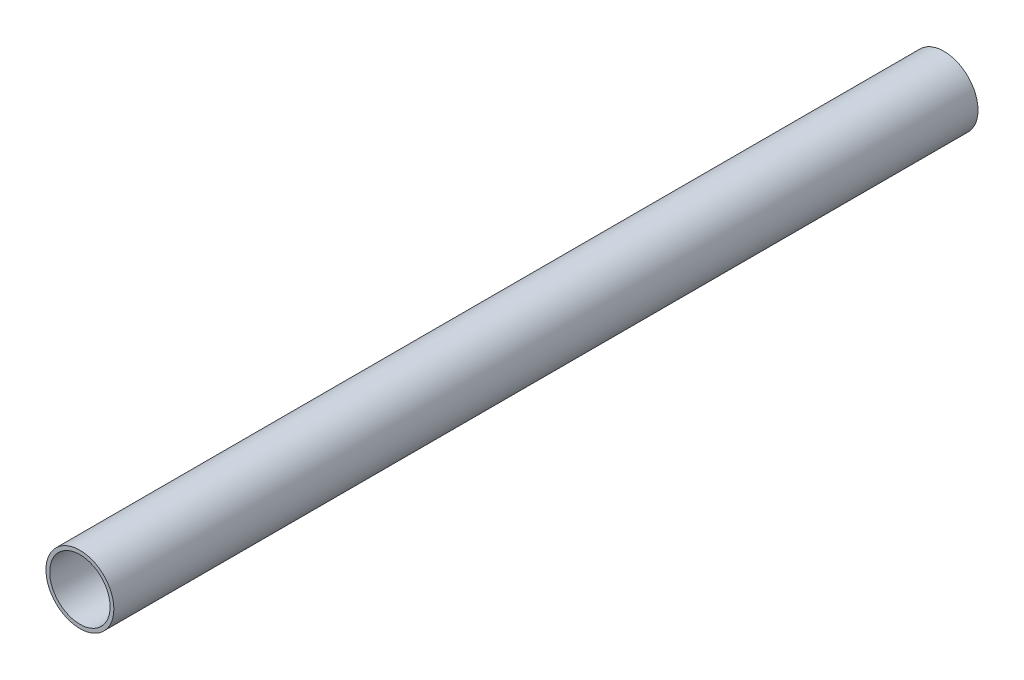
ISO-10303-21;
HEADER;
FILE_DESCRIPTION(('STEP AP214'),'2;1');
FILE_NAME('part.step','',(''),(''),'','','');
FILE_SCHEMA(('AUTOMOTIVE_DESIGN { 1 0 10303 214 1 1 1 1 }'));
ENDSEC;
DATA;
#1=APPLICATION_CONTEXT('core data for automotive mechanical design processes');
#2=APPLICATION_PROTOCOL_DEFINITION('international standard','automotive_design',2000,#1);
#3=PRODUCT_CONTEXT('',#1,'mechanical');
#4=PRODUCT('Part','Part','',(#3));
#5=PRODUCT_RELATED_PRODUCT_CATEGORY('part','',(#4));
#6=PRODUCT_DEFINITION_FORMATION('','',#4);
#7=PRODUCT_DEFINITION_CONTEXT('part definition',#1,'design');
#8=PRODUCT_DEFINITION('design','',#6,#7);
#9=PRODUCT_DEFINITION_SHAPE('','',#8);
#10=(LENGTH_UNIT() NAMED_UNIT(*) SI_UNIT(.MILLI.,.METRE.));
#11=(NAMED_UNIT(*) PLANE_ANGLE_UNIT() SI_UNIT($,.RADIAN.));
#12=(NAMED_UNIT(*) SI_UNIT($,.STERADIAN.) SOLID_ANGLE_UNIT());
#13=UNCERTAINTY_MEASURE_WITH_UNIT(LENGTH_MEASURE(1.E-05),#10,'distance_accuracy_value','');
#14=(GEOMETRIC_REPRESENTATION_CONTEXT(3) GLOBAL_UNCERTAINTY_ASSIGNED_CONTEXT((#13)) GLOBAL_UNIT_ASSIGNED_CONTEXT((#10,
#11,#12)) REPRESENTATION_CONTEXT('',''));
#15=CARTESIAN_POINT('',(0.,0.,0.));
#16=DIRECTION('',(0.,0.,1.));
#17=DIRECTION('',(1.,0.,0.));
#18=AXIS2_PLACEMENT_3D('',#15,#16,#17);
#19=CARTESIAN_POINT('',(0.,0.,343.5));
#20=DIRECTION('',(0.,0.,1.));
#21=DIRECTION('',(1.,0.,0.));
#22=AXIS2_PLACEMENT_3D('',#19,#20,#21);
#23=PLANE('',#22);
#24=CARTESIAN_POINT('',(0.,0.,343.5));
#25=DIRECTION('',(0.,0.,1.));
#26=DIRECTION('',(1.,0.,0.));
#27=AXIS2_PLACEMENT_3D('',#24,#25,#26);
#28=CIRCLE('',#27,13.5);
#29=CARTESIAN_POINT('',(13.5,0.,343.5));
#30=VERTEX_POINT('',#29);
#31=EDGE_CURVE('E10',#30,#30,#28,.T.);
#32=ORIENTED_EDGE('',*,*,#31,.T.);
#33=EDGE_LOOP('',(#32));
#34=FACE_BOUND('',#33,.T.);
#35=CARTESIAN_POINT('',(0.,0.,343.5));
#36=DIRECTION('',(0.,0.,1.));
#37=DIRECTION('',(1.,0.,0.));
#38=AXIS2_PLACEMENT_3D('',#35,#36,#37);
#39=CIRCLE('',#38,12.);
#40=CARTESIAN_POINT('',(12.,0.,343.5));
#41=VERTEX_POINT('',#40);
#42=EDGE_CURVE('E50',#41,#41,#39,.T.);
#43=ORIENTED_EDGE('',*,*,#42,.F.);
#44=EDGE_LOOP('',(#43));
#45=FACE_BOUND('',#44,.T.);
#46=ADVANCED_FACE('F37',(#34,#45),#23,.T.);
#47=CARTESIAN_POINT('',(0.,0.,0.));
#48=DIRECTION('',(0.,0.,1.));
#49=DIRECTION('',(1.,0.,0.));
#50=AXIS2_PLACEMENT_3D('',#47,#48,#49);
#51=PLANE('',#50);
#52=CARTESIAN_POINT('',(0.,0.,0.));
#53=DIRECTION('',(0.,0.,1.));
#54=DIRECTION('',(1.,0.,0.));
#55=AXIS2_PLACEMENT_3D('',#52,#53,#54);
#56=CIRCLE('',#55,13.5);
#57=CARTESIAN_POINT('',(13.5,0.,0.));
#58=VERTEX_POINT('',#57);
#59=EDGE_CURVE('E41',#58,#58,#56,.T.);
#60=ORIENTED_EDGE('',*,*,#59,.F.);
#61=EDGE_LOOP('',(#60));
#62=FACE_BOUND('',#61,.T.);
#63=CARTESIAN_POINT('',(0.,0.,0.));
#64=DIRECTION('',(0.,0.,1.));
#65=DIRECTION('',(1.,0.,0.));
#66=AXIS2_PLACEMENT_3D('',#63,#64,#65);
#67=CIRCLE('',#66,12.);
#68=CARTESIAN_POINT('',(12.,0.,0.));
#69=VERTEX_POINT('',#68);
#70=EDGE_CURVE('E52',#69,#69,#67,.T.);
#71=ORIENTED_EDGE('',*,*,#70,.T.);
#72=EDGE_LOOP('',(#71));
#73=FACE_BOUND('',#72,.T.);
#74=ADVANCED_FACE('F64',(#62,#73),#51,.F.);
#75=CARTESIAN_POINT('',(0.,0.,343.5));
#76=DIRECTION('',(0.,0.,-1.));
#77=DIRECTION('',(-1.,0.,0.));
#78=AXIS2_PLACEMENT_3D('',#75,#76,#77);
#79=CYLINDRICAL_SURFACE('',#78,13.5);
#80=ORIENTED_EDGE('',*,*,#31,.F.);
#81=EDGE_LOOP('',(#80));
#82=FACE_BOUND('',#81,.T.);
#83=ORIENTED_EDGE('',*,*,#59,.T.);
#84=EDGE_LOOP('',(#83));
#85=FACE_BOUND('',#84,.T.);
#86=ADVANCED_FACE('F39',(#82,#85),#79,.T.);
#87=CARTESIAN_POINT('',(0.,0.,343.5));
#88=DIRECTION('',(0.,0.,-1.));
#89=DIRECTION('',(-1.,0.,0.));
#90=AXIS2_PLACEMENT_3D('',#87,#88,#89);
#91=CYLINDRICAL_SURFACE('',#90,12.);
#92=ORIENTED_EDGE('',*,*,#42,.T.);
#93=EDGE_LOOP('',(#92));
#94=FACE_BOUND('',#93,.T.);
#95=ORIENTED_EDGE('',*,*,#70,.F.);
#96=EDGE_LOOP('',(#95));
#97=FACE_BOUND('',#96,.T.);
#98=ADVANCED_FACE('F60',(#94,#97),#91,.F.);
#99=CLOSED_SHELL('',(#46,#74,#86,#98));
#100=MANIFOLD_SOLID_BREP('B2',#99);
#101=ADVANCED_BREP_SHAPE_REPRESENTATION('',(#18,#100),#14);
#102=SHAPE_DEFINITION_REPRESENTATION(#9,#101);
ENDSEC;
END-ISO-10303-21;
